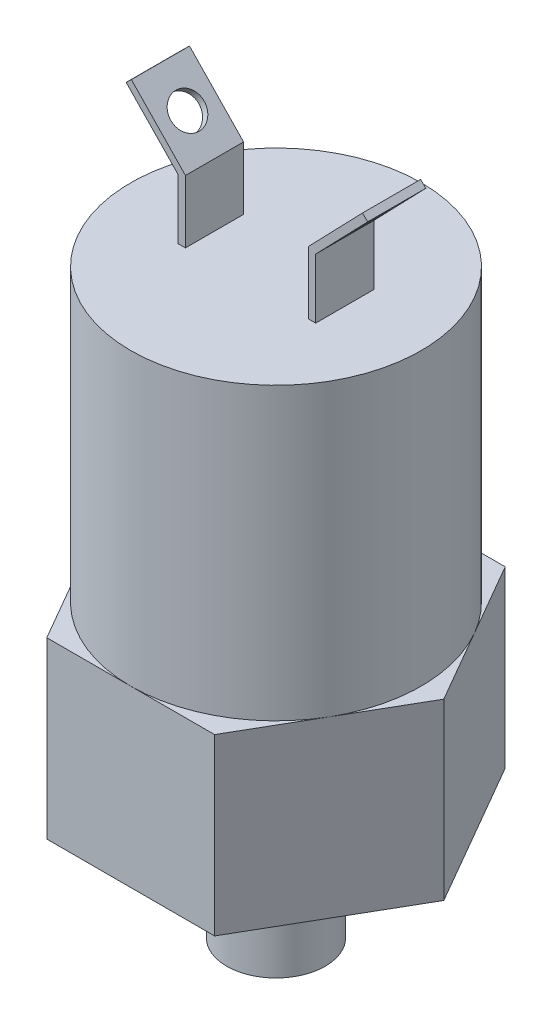
ISO-10303-21;
HEADER;
FILE_DESCRIPTION(('STEP AP214'),'2;1');
FILE_NAME('part.step','',(''),(''),'','','');
FILE_SCHEMA(('AUTOMOTIVE_DESIGN { 1 0 10303 214 1 1 1 1 }'));
ENDSEC;
DATA;
#1=APPLICATION_CONTEXT('core data for automotive mechanical design processes');
#2=APPLICATION_PROTOCOL_DEFINITION('international standard','automotive_design',2000,#1);
#3=PRODUCT_CONTEXT('',#1,'mechanical');
#4=PRODUCT('Part','Part','',(#3));
#5=PRODUCT_RELATED_PRODUCT_CATEGORY('part','',(#4));
#6=PRODUCT_DEFINITION_FORMATION('','',#4);
#7=PRODUCT_DEFINITION_CONTEXT('part definition',#1,'design');
#8=PRODUCT_DEFINITION('design','',#6,#7);
#9=PRODUCT_DEFINITION_SHAPE('','',#8);
#10=(LENGTH_UNIT() NAMED_UNIT(*) SI_UNIT(.MILLI.,.METRE.));
#11=(NAMED_UNIT(*) PLANE_ANGLE_UNIT() SI_UNIT($,.RADIAN.));
#12=(NAMED_UNIT(*) SI_UNIT($,.STERADIAN.) SOLID_ANGLE_UNIT());
#13=UNCERTAINTY_MEASURE_WITH_UNIT(LENGTH_MEASURE(1.E-05),#10,'distance_accuracy_value','');
#14=(GEOMETRIC_REPRESENTATION_CONTEXT(3) GLOBAL_UNCERTAINTY_ASSIGNED_CONTEXT((#13)) GLOBAL_UNIT_ASSIGNED_CONTEXT((#10,
#11,#12)) REPRESENTATION_CONTEXT('',''));
#15=CARTESIAN_POINT('',(0.,0.,0.));
#16=DIRECTION('',(0.,0.,1.));
#17=DIRECTION('',(1.,0.,0.));
#18=AXIS2_PLACEMENT_3D('',#15,#16,#17);
#19=CARTESIAN_POINT('',(-5.91916388064722,45.774740059957,2.54));
#20=DIRECTION('',(-0.719626723782185,-0.694361129685785,0.));
#21=DIRECTION('',(0.694361129685785,-0.719626723782185,0.));
#22=AXIS2_PLACEMENT_3D('',#19,#20,#21);
#23=PLANE('',#22);
#24=DIRECTION('',(-0.694361129685785,0.719626723782185,0.));
#25=VECTOR('',#24,1.);
#26=CARTESIAN_POINT('',(-5.91916388064722,45.774740059957,-2.54));
#27=LINE('',#26,#25);
#28=CARTESIAN_POINT('',(-6.00818239584637,45.8669976759295,-2.54));
#29=VERTEX_POINT('',#28);
#30=CARTESIAN_POINT('',(-10.5552709637061,50.5795403413248,-2.54));
#31=VERTEX_POINT('',#30);
#32=EDGE_CURVE('E183',#29,#31,#27,.T.);
#33=ORIENTED_EDGE('',*,*,#32,.F.);
#34=DIRECTION('',(0.,0.,-1.));
#35=VECTOR('',#34,1.);
#36=CARTESIAN_POINT('',(-6.00818239584637,45.8669976759295,2.54));
#37=LINE('',#36,#35);
#38=CARTESIAN_POINT('',(-6.00818239584637,45.8669976759295,2.54));
#39=VERTEX_POINT('',#38);
#40=EDGE_CURVE('E178',#39,#29,#37,.T.);
#41=ORIENTED_EDGE('',*,*,#40,.F.);
#42=DIRECTION('',(-0.694361129685785,0.719626723782185,0.));
#43=VECTOR('',#42,1.);
#44=CARTESIAN_POINT('',(-5.91916388064722,45.774740059957,2.54));
#45=LINE('',#44,#43);
#46=CARTESIAN_POINT('',(-10.5552709637061,50.5795403413248,2.54));
#47=VERTEX_POINT('',#46);
#48=EDGE_CURVE('E181',#39,#47,#45,.T.);
#49=ORIENTED_EDGE('',*,*,#48,.T.);
#50=DIRECTION('',(0.,0.,-1.));
#51=VECTOR('',#50,1.);
#52=CARTESIAN_POINT('',(-10.5552709637061,50.5795403413248,2.54));
#53=LINE('',#52,#51);
#54=EDGE_CURVE('E210',#47,#31,#53,.T.);
#55=ORIENTED_EDGE('',*,*,#54,.T.);
#56=EDGE_LOOP('',(#33,#41,#49,#55));
#57=FACE_BOUND('',#56,.T.);
#58=CARTESIAN_POINT('',(-8.19270816457709,48.1310113926547,0.));
#59=DIRECTION('',(-0.719626723782185,-0.694361129685785,0.));
#60=DIRECTION('',(0.694361129685785,-0.719626723782185,0.));
#61=AXIS2_PLACEMENT_3D('',#58,#59,#60);
#62=CIRCLE('',#61,1.4605);
#63=CARTESIAN_POINT('',(-7.17859373467101,47.0799965625708,0.));
#64=VERTEX_POINT('',#63);
#65=EDGE_CURVE('E213',#64,#64,#62,.T.);
#66=ORIENTED_EDGE('',*,*,#65,.F.);
#67=EDGE_LOOP('',(#66));
#68=FACE_BOUND('',#67,.T.);
#69=ADVANCED_FACE('F37',(#57,#68),#23,.T.);
#70=CARTESIAN_POINT('',(-5.46220091104553,46.2156593773075,2.54));
#71=DIRECTION('',(-0.719626723782185,-0.694361129685785,0.));
#72=DIRECTION('',(0.694361129685785,-0.719626723782185,0.));
#73=AXIS2_PLACEMENT_3D('',#70,#71,#72);
#74=PLANE('',#73);
#75=DIRECTION('',(-0.694361129685785,0.719626723782185,0.));
#76=VECTOR('',#75,1.);
#77=CARTESIAN_POINT('',(-5.46220091104553,46.2156593773075,-2.54));
#78=LINE('',#77,#76);
#79=CARTESIAN_POINT('',(-5.37318239584637,46.1234017613351,-2.54));
#80=VERTEX_POINT('',#79);
#81=CARTESIAN_POINT('',(-10.0983079941044,51.0204596586752,-2.54));
#82=VERTEX_POINT('',#81);
#83=EDGE_CURVE('E219',#80,#82,#78,.T.);
#84=ORIENTED_EDGE('',*,*,#83,.T.);
#85=DIRECTION('',(0.,0.,-1.));
#86=VECTOR('',#85,1.);
#87=CARTESIAN_POINT('',(-10.0983079941044,51.0204596586752,2.54));
#88=LINE('',#87,#86);
#89=CARTESIAN_POINT('',(-10.0983079941044,51.0204596586752,2.54));
#90=VERTEX_POINT('',#89);
#91=EDGE_CURVE('E224',#90,#82,#88,.T.);
#92=ORIENTED_EDGE('',*,*,#91,.F.);
#93=DIRECTION('',(-0.694361129685785,0.719626723782185,0.));
#94=VECTOR('',#93,1.);
#95=CARTESIAN_POINT('',(-5.46220091104553,46.2156593773075,2.54));
#96=LINE('',#95,#94);
#97=CARTESIAN_POINT('',(-5.37318239584637,46.1234017613351,2.54));
#98=VERTEX_POINT('',#97);
#99=EDGE_CURVE('E207',#98,#90,#96,.T.);
#100=ORIENTED_EDGE('',*,*,#99,.F.);
#101=DIRECTION('',(0.,0.,-1.));
#102=VECTOR('',#101,1.);
#103=CARTESIAN_POINT('',(-5.37318239584637,46.1234017613351,2.54));
#104=LINE('',#103,#102);
#105=EDGE_CURVE('E227',#98,#80,#104,.T.);
#106=ORIENTED_EDGE('',*,*,#105,.T.);
#107=EDGE_LOOP('',(#84,#92,#100,#106));
#108=FACE_BOUND('',#107,.T.);
#109=CARTESIAN_POINT('',(-7.7357451949754,48.5719307100052,0.));
#110=DIRECTION('',(-0.719626723782185,-0.694361129685785,0.));
#111=DIRECTION('',(0.694361129685785,-0.719626723782185,0.));
#112=AXIS2_PLACEMENT_3D('',#109,#110,#111);
#113=CIRCLE('',#112,1.4605);
#114=CARTESIAN_POINT('',(-6.72163076506931,47.5209158799213,0.));
#115=VERTEX_POINT('',#114);
#116=EDGE_CURVE('E694',#115,#115,#113,.T.);
#117=ORIENTED_EDGE('',*,*,#116,.T.);
#118=EDGE_LOOP('',(#117));
#119=FACE_BOUND('',#118,.T.);
#120=ADVANCED_FACE('F419',(#108,#119),#74,.F.);
#121=CARTESIAN_POINT('',(0.,40.64,0.));
#122=DIRECTION('',(0.,1.,0.));
#123=DIRECTION('',(0.,0.,1.));
#124=AXIS2_PLACEMENT_3D('',#121,#122,#123);
#125=PLANE('',#124);
#126=DIRECTION('',(0.,0.,-1.));
#127=VECTOR('',#126,1.);
#128=CARTESIAN_POINT('',(6.00818239584637,40.64,2.54));
#129=LINE('',#128,#127);
#130=CARTESIAN_POINT('',(6.00818239584637,40.64,2.54));
#131=VERTEX_POINT('',#130);
#132=CARTESIAN_POINT('',(6.00818239584637,40.64,-2.54));
#133=VERTEX_POINT('',#132);
#134=EDGE_CURVE('E272',#131,#133,#129,.T.);
#135=ORIENTED_EDGE('',*,*,#134,.F.);
#136=DIRECTION('',(-1.,0.,0.));
#137=VECTOR('',#136,1.);
#138=CARTESIAN_POINT('',(6.00818239584637,40.64,2.54));
#139=LINE('',#138,#137);
#140=CARTESIAN_POINT('',(5.37318239584637,40.64,2.54));
#141=VERTEX_POINT('',#140);
#142=EDGE_CURVE('E250',#131,#141,#139,.T.);
#143=ORIENTED_EDGE('',*,*,#142,.T.);
#144=DIRECTION('',(0.,0.,-1.));
#145=VECTOR('',#144,1.);
#146=CARTESIAN_POINT('',(5.37318239584637,40.64,2.54));
#147=LINE('',#146,#145);
#148=CARTESIAN_POINT('',(5.37318239584637,40.64,-2.54));
#149=VERTEX_POINT('',#148);
#150=EDGE_CURVE('E275',#141,#149,#147,.T.);
#151=ORIENTED_EDGE('',*,*,#150,.T.);
#152=DIRECTION('',(-1.,0.,0.));
#153=VECTOR('',#152,1.);
#154=CARTESIAN_POINT('',(6.00818239584637,40.64,-2.54));
#155=LINE('',#154,#153);
#156=EDGE_CURVE('E266',#133,#149,#155,.T.);
#157=ORIENTED_EDGE('',*,*,#156,.F.);
#158=EDGE_LOOP('',(#135,#143,#151,#157));
#159=FACE_BOUND('',#158,.T.);
#160=CARTESIAN_POINT('',(0.,40.64,0.));
#161=DIRECTION('',(0.,1.,0.));
#162=DIRECTION('',(0.,0.,1.));
#163=AXIS2_PLACEMENT_3D('',#160,#161,#162);
#164=CIRCLE('',#163,12.7);
#165=CARTESIAN_POINT('',(0.,40.64,12.7));
#166=VERTEX_POINT('',#165);
#167=EDGE_CURVE('E287',#166,#166,#164,.T.);
#168=ORIENTED_EDGE('',*,*,#167,.T.);
#169=EDGE_LOOP('',(#168));
#170=FACE_BOUND('',#169,.T.);
#171=DIRECTION('',(0.,0.,-1.));
#172=VECTOR('',#171,1.);
#173=CARTESIAN_POINT('',(-5.37318239584637,40.64,2.54));
#174=LINE('',#173,#172);
#175=CARTESIAN_POINT('',(-5.37318239584637,40.64,2.54));
#176=VERTEX_POINT('',#175);
#177=CARTESIAN_POINT('',(-5.37318239584637,40.64,-2.54));
#178=VERTEX_POINT('',#177);
#179=EDGE_CURVE('E57',#176,#178,#174,.T.);
#180=ORIENTED_EDGE('',*,*,#179,.F.);
#181=DIRECTION('',(1.,0.,0.));
#182=VECTOR('',#181,1.);
#183=CARTESIAN_POINT('',(-6.00818239584637,40.64,2.54));
#184=LINE('',#183,#182);
#185=CARTESIAN_POINT('',(-6.00818239584637,40.64,2.54));
#186=VERTEX_POINT('',#185);
#187=EDGE_CURVE('E52',#186,#176,#184,.T.);
#188=ORIENTED_EDGE('',*,*,#187,.F.);
#189=DIRECTION('',(0.,0.,-1.));
#190=VECTOR('',#189,1.);
#191=CARTESIAN_POINT('',(-6.00818239584637,40.64,2.54));
#192=LINE('',#191,#190);
#193=CARTESIAN_POINT('',(-6.00818239584637,40.64,-2.54));
#194=VERTEX_POINT('',#193);
#195=EDGE_CURVE('E189',#186,#194,#192,.T.);
#196=ORIENTED_EDGE('',*,*,#195,.T.);
#197=DIRECTION('',(1.,0.,0.));
#198=VECTOR('',#197,1.);
#199=CARTESIAN_POINT('',(-6.00818239584637,40.64,-2.54));
#200=LINE('',#199,#198);
#201=EDGE_CURVE('E215',#194,#178,#200,.T.);
#202=ORIENTED_EDGE('',*,*,#201,.T.);
#203=EDGE_LOOP('',(#180,#188,#196,#202));
#204=FACE_BOUND('',#203,.T.);
#205=ADVANCED_FACE('F425',(#159,#170,#204),#125,.T.);
#206=CARTESIAN_POINT('',(0.,0.,0.));
#207=DIRECTION('',(0.,1.,0.));
#208=DIRECTION('',(0.,0.,1.));
#209=AXIS2_PLACEMENT_3D('',#206,#207,#208);
#210=PLANE('',#209);
#211=DIRECTION('',(-0.5,0.,-0.866025403784439));
#212=VECTOR('',#211,1.);
#213=CARTESIAN_POINT('',(14.6646968374165,0.,0.));
#214=LINE('',#213,#212);
#215=CARTESIAN_POINT('',(14.6646968374165,0.,0.));
#216=VERTEX_POINT('',#215);
#217=CARTESIAN_POINT('',(7.33234841870825,0.,-12.7));
#218=VERTEX_POINT('',#217);
#219=EDGE_CURVE('E290',#216,#218,#214,.T.);
#220=ORIENTED_EDGE('',*,*,#219,.F.);
#221=DIRECTION('',(0.5,0.,-0.866025403784439));
#222=VECTOR('',#221,1.);
#223=CARTESIAN_POINT('',(7.33234841870825,0.,12.7));
#224=LINE('',#223,#222);
#225=CARTESIAN_POINT('',(7.33234841870825,0.,12.7));
#226=VERTEX_POINT('',#225);
#227=EDGE_CURVE('E328',#226,#216,#224,.T.);
#228=ORIENTED_EDGE('',*,*,#227,.F.);
#229=DIRECTION('',(1.,0.,0.));
#230=VECTOR('',#229,1.);
#231=CARTESIAN_POINT('',(-7.33234841870824,0.,12.7));
#232=LINE('',#231,#230);
#233=CARTESIAN_POINT('',(-7.33234841870824,0.,12.7));
#234=VERTEX_POINT('',#233);
#235=EDGE_CURVE('E326',#234,#226,#232,.T.);
#236=ORIENTED_EDGE('',*,*,#235,.F.);
#237=DIRECTION('',(0.5,0.,0.866025403784439));
#238=VECTOR('',#237,1.);
#239=CARTESIAN_POINT('',(-14.6646968374165,0.,0.));
#240=LINE('',#239,#238);
#241=CARTESIAN_POINT('',(-14.6646968374165,0.,0.));
#242=VERTEX_POINT('',#241);
#243=EDGE_CURVE('E324',#242,#234,#240,.T.);
#244=ORIENTED_EDGE('',*,*,#243,.F.);
#245=DIRECTION('',(-0.5,0.,0.866025403784439));
#246=VECTOR('',#245,1.);
#247=CARTESIAN_POINT('',(-7.33234841870825,0.,-12.7));
#248=LINE('',#247,#246);
#249=CARTESIAN_POINT('',(-7.33234841870825,0.,-12.7));
#250=VERTEX_POINT('',#249);
#251=EDGE_CURVE('E322',#250,#242,#248,.T.);
#252=ORIENTED_EDGE('',*,*,#251,.F.);
#253=DIRECTION('',(-1.,0.,0.));
#254=VECTOR('',#253,1.);
#255=CARTESIAN_POINT('',(7.33234841870825,0.,-12.7));
#256=LINE('',#255,#254);
#257=EDGE_CURVE('E320',#218,#250,#256,.T.);
#258=ORIENTED_EDGE('',*,*,#257,.F.);
#259=EDGE_LOOP('',(#220,#228,#236,#244,#252,#258));
#260=FACE_BOUND('',#259,.T.);
#261=CARTESIAN_POINT('',(0.,0.,0.));
#262=DIRECTION('',(0.,1.,0.));
#263=DIRECTION('',(0.,0.,1.));
#264=AXIS2_PLACEMENT_3D('',#261,#262,#263);
#265=CIRCLE('',#264,4.3053);
#266=CARTESIAN_POINT('',(0.,0.,4.3053));
#267=VERTEX_POINT('',#266);
#268=EDGE_CURVE('E11',#267,#267,#265,.F.);
#269=ORIENTED_EDGE('',*,*,#268,.F.);
#270=EDGE_LOOP('',(#269));
#271=FACE_BOUND('',#270,.T.);
#272=ADVANCED_FACE('F378',(#260,#271),#210,.F.);
#273=CARTESIAN_POINT('',(0.,15.24,0.));
#274=DIRECTION('',(0.,1.,0.));
#275=DIRECTION('',(0.,0.,1.));
#276=AXIS2_PLACEMENT_3D('',#273,#274,#275);
#277=PLANE('',#276);
#278=CARTESIAN_POINT('',(0.,15.24,0.));
#279=DIRECTION('',(0.,1.,0.));
#280=DIRECTION('',(0.,0.,1.));
#281=AXIS2_PLACEMENT_3D('',#278,#279,#280);
#282=CIRCLE('',#281,12.7);
#283=CARTESIAN_POINT('',(0.,15.24,12.7));
#284=VERTEX_POINT('',#283);
#285=CARTESIAN_POINT('',(10.9985226280624,15.24,6.35));
#286=VERTEX_POINT('',#285);
#287=EDGE_CURVE('E286',#284,#286,#282,.T.);
#288=ORIENTED_EDGE('',*,*,#287,.F.);
#289=DIRECTION('',(1.,0.,0.));
#290=VECTOR('',#289,1.);
#291=CARTESIAN_POINT('',(-7.33234841870824,15.24,12.7));
#292=LINE('',#291,#290);
#293=CARTESIAN_POINT('',(7.33234841870825,15.24,12.7));
#294=VERTEX_POINT('',#293);
#295=EDGE_CURVE('E310',#284,#294,#292,.T.);
#296=ORIENTED_EDGE('',*,*,#295,.T.);
#297=DIRECTION('',(0.5,0.,-0.866025403784439));
#298=VECTOR('',#297,1.);
#299=CARTESIAN_POINT('',(7.33234841870825,15.24,12.7));
#300=LINE('',#299,#298);
#301=EDGE_CURVE('E314',#294,#286,#300,.T.);
#302=ORIENTED_EDGE('',*,*,#301,.T.);
#303=EDGE_LOOP('',(#288,#296,#302));
#304=FACE_BOUND('',#303,.T.);
#305=ADVANCED_FACE('F368',(#304),#277,.T.);
#306=CARTESIAN_POINT('',(10.9985226280624,15.24,-6.35));
#307=VERTEX_POINT('',#306);
#308=EDGE_CURVE('E45',#286,#307,#282,.T.);
#309=ORIENTED_EDGE('',*,*,#308,.F.);
#310=CARTESIAN_POINT('',(14.6646968374165,15.24,0.));
#311=VERTEX_POINT('',#310);
#312=EDGE_CURVE('E313',#286,#311,#300,.T.);
#313=ORIENTED_EDGE('',*,*,#312,.T.);
#314=DIRECTION('',(-0.5,0.,-0.866025403784439));
#315=VECTOR('',#314,1.);
#316=CARTESIAN_POINT('',(14.6646968374165,15.24,0.));
#317=LINE('',#316,#315);
#318=EDGE_CURVE('E294',#311,#307,#317,.T.);
#319=ORIENTED_EDGE('',*,*,#318,.T.);
#320=EDGE_LOOP('',(#309,#313,#319));
#321=FACE_BOUND('',#320,.T.);
#322=ADVANCED_FACE('F361',(#321),#277,.T.);
#323=CARTESIAN_POINT('',(0.,15.24,-12.7));
#324=VERTEX_POINT('',#323);
#325=EDGE_CURVE('E354',#307,#324,#282,.T.);
#326=ORIENTED_EDGE('',*,*,#325,.F.);
#327=CARTESIAN_POINT('',(7.33234841870825,15.24,-12.7));
#328=VERTEX_POINT('',#327);
#329=EDGE_CURVE('E298',#307,#328,#317,.T.);
#330=ORIENTED_EDGE('',*,*,#329,.T.);
#331=DIRECTION('',(-1.,0.,0.));
#332=VECTOR('',#331,1.);
#333=CARTESIAN_POINT('',(7.33234841870825,15.24,-12.7));
#334=LINE('',#333,#332);
#335=EDGE_CURVE('E299',#328,#324,#334,.T.);
#336=ORIENTED_EDGE('',*,*,#335,.T.);
#337=EDGE_LOOP('',(#326,#330,#336));
#338=FACE_BOUND('',#337,.T.);
#339=ADVANCED_FACE('F385',(#338),#277,.T.);
#340=CARTESIAN_POINT('',(-10.9985226280624,15.24,-6.35));
#341=VERTEX_POINT('',#340);
#342=EDGE_CURVE('E352',#324,#341,#282,.T.);
#343=ORIENTED_EDGE('',*,*,#342,.F.);
#344=CARTESIAN_POINT('',(-7.33234841870825,15.24,-12.7));
#345=VERTEX_POINT('',#344);
#346=EDGE_CURVE('E297',#324,#345,#334,.T.);
#347=ORIENTED_EDGE('',*,*,#346,.T.);
#348=DIRECTION('',(-0.5,0.,0.866025403784439));
#349=VECTOR('',#348,1.);
#350=CARTESIAN_POINT('',(-7.33234841870825,15.24,-12.7));
#351=LINE('',#350,#349);
#352=EDGE_CURVE('E303',#345,#341,#351,.T.);
#353=ORIENTED_EDGE('',*,*,#352,.T.);
#354=EDGE_LOOP('',(#343,#347,#353));
#355=FACE_BOUND('',#354,.T.);
#356=ADVANCED_FACE('F391',(#355),#277,.T.);
#357=CARTESIAN_POINT('',(-10.9985226280624,15.24,6.35));
#358=VERTEX_POINT('',#357);
#359=EDGE_CURVE('E349',#341,#358,#282,.T.);
#360=ORIENTED_EDGE('',*,*,#359,.F.);
#361=CARTESIAN_POINT('',(-14.6646968374165,15.24,0.));
#362=VERTEX_POINT('',#361);
#363=EDGE_CURVE('E302',#341,#362,#351,.T.);
#364=ORIENTED_EDGE('',*,*,#363,.T.);
#365=DIRECTION('',(0.5,0.,0.866025403784439));
#366=VECTOR('',#365,1.);
#367=CARTESIAN_POINT('',(-14.6646968374165,15.24,0.));
#368=LINE('',#367,#366);
#369=EDGE_CURVE('E307',#362,#358,#368,.T.);
#370=ORIENTED_EDGE('',*,*,#369,.T.);
#371=EDGE_LOOP('',(#360,#364,#370));
#372=FACE_BOUND('',#371,.T.);
#373=ADVANCED_FACE('F398',(#372),#277,.T.);
#374=CARTESIAN_POINT('',(14.6646968374165,15.24,0.));
#375=DIRECTION('',(-0.866025403784439,0.,0.5));
#376=DIRECTION('',(0.5,0.,0.866025403784439));
#377=AXIS2_PLACEMENT_3D('',#374,#375,#376);
#378=PLANE('',#377);
#379=ORIENTED_EDGE('',*,*,#219,.T.);
#380=DIRECTION('',(0.,-1.,0.));
#381=VECTOR('',#380,1.);
#382=CARTESIAN_POINT('',(7.33234841870825,15.24,-12.7));
#383=LINE('',#382,#381);
#384=EDGE_CURVE('E343',#328,#218,#383,.T.);
#385=ORIENTED_EDGE('',*,*,#384,.F.);
#386=ORIENTED_EDGE('',*,*,#329,.F.);
#387=ORIENTED_EDGE('',*,*,#318,.F.);
#388=DIRECTION('',(0.,-1.,0.));
#389=VECTOR('',#388,1.);
#390=CARTESIAN_POINT('',(14.6646968374165,15.24,0.));
#391=LINE('',#390,#389);
#392=EDGE_CURVE('E317',#311,#216,#391,.T.);
#393=ORIENTED_EDGE('',*,*,#392,.T.);
#394=EDGE_LOOP('',(#379,#385,#386,#387,#393));
#395=FACE_BOUND('',#394,.T.);
#396=ADVANCED_FACE('F39',(#395),#378,.F.);
#397=CARTESIAN_POINT('',(7.33234841870825,15.24,-12.7));
#398=DIRECTION('',(0.,0.,1.));
#399=DIRECTION('',(1.,0.,0.));
#400=AXIS2_PLACEMENT_3D('',#397,#398,#399);
#401=PLANE('',#400);
#402=ORIENTED_EDGE('',*,*,#257,.T.);
#403=DIRECTION('',(0.,-1.,0.));
#404=VECTOR('',#403,1.);
#405=CARTESIAN_POINT('',(-7.33234841870825,15.24,-12.7));
#406=LINE('',#405,#404);
#407=EDGE_CURVE('E341',#345,#250,#406,.T.);
#408=ORIENTED_EDGE('',*,*,#407,.F.);
#409=ORIENTED_EDGE('',*,*,#346,.F.);
#410=ORIENTED_EDGE('',*,*,#335,.F.);
#411=ORIENTED_EDGE('',*,*,#384,.T.);
#412=EDGE_LOOP('',(#402,#408,#409,#410,#411));
#413=FACE_BOUND('',#412,.T.);
#414=ADVANCED_FACE('F387',(#413),#401,.F.);
#415=CARTESIAN_POINT('',(-7.33234841870825,15.24,-12.7));
#416=DIRECTION('',(0.866025403784439,0.,0.5));
#417=DIRECTION('',(0.5,0.,-0.866025403784439));
#418=AXIS2_PLACEMENT_3D('',#415,#416,#417);
#419=PLANE('',#418);
#420=ORIENTED_EDGE('',*,*,#251,.T.);
#421=DIRECTION('',(0.,-1.,0.));
#422=VECTOR('',#421,1.);
#423=CARTESIAN_POINT('',(-14.6646968374165,15.24,0.));
#424=LINE('',#423,#422);
#425=EDGE_CURVE('E338',#362,#242,#424,.T.);
#426=ORIENTED_EDGE('',*,*,#425,.F.);
#427=ORIENTED_EDGE('',*,*,#363,.F.);
#428=ORIENTED_EDGE('',*,*,#352,.F.);
#429=ORIENTED_EDGE('',*,*,#407,.T.);
#430=EDGE_LOOP('',(#420,#426,#427,#428,#429));
#431=FACE_BOUND('',#430,.T.);
#432=ADVANCED_FACE('F394',(#431),#419,.F.);
#433=CARTESIAN_POINT('',(-14.6646968374165,15.24,0.));
#434=DIRECTION('',(0.866025403784439,0.,-0.5));
#435=DIRECTION('',(-0.5,0.,-0.866025403784439));
#436=AXIS2_PLACEMENT_3D('',#433,#434,#435);
#437=PLANE('',#436);
#438=ORIENTED_EDGE('',*,*,#243,.T.);
#439=DIRECTION('',(0.,-1.,0.));
#440=VECTOR('',#439,1.);
#441=CARTESIAN_POINT('',(-7.33234841870824,15.24,12.7));
#442=LINE('',#441,#440);
#443=CARTESIAN_POINT('',(-7.33234841870824,15.24,12.7));
#444=VERTEX_POINT('',#443);
#445=EDGE_CURVE('E335',#444,#234,#442,.T.);
#446=ORIENTED_EDGE('',*,*,#445,.F.);
#447=EDGE_CURVE('E306',#358,#444,#368,.T.);
#448=ORIENTED_EDGE('',*,*,#447,.F.);
#449=ORIENTED_EDGE('',*,*,#369,.F.);
#450=ORIENTED_EDGE('',*,*,#425,.T.);
#451=EDGE_LOOP('',(#438,#446,#448,#449,#450));
#452=FACE_BOUND('',#451,.T.);
#453=ADVANCED_FACE('F401',(#452),#437,.F.);
#454=CARTESIAN_POINT('',(-7.33234841870824,15.24,12.7));
#455=DIRECTION('',(0.,0.,-1.));
#456=DIRECTION('',(-1.,0.,0.));
#457=AXIS2_PLACEMENT_3D('',#454,#455,#456);
#458=PLANE('',#457);
#459=ORIENTED_EDGE('',*,*,#235,.T.);
#460=DIRECTION('',(0.,-1.,0.));
#461=VECTOR('',#460,1.);
#462=CARTESIAN_POINT('',(7.33234841870825,15.24,12.7));
#463=LINE('',#462,#461);
#464=EDGE_CURVE('E332',#294,#226,#463,.T.);
#465=ORIENTED_EDGE('',*,*,#464,.F.);
#466=ORIENTED_EDGE('',*,*,#295,.F.);
#467=EDGE_CURVE('E311',#444,#284,#292,.T.);
#468=ORIENTED_EDGE('',*,*,#467,.F.);
#469=ORIENTED_EDGE('',*,*,#445,.T.);
#470=EDGE_LOOP('',(#459,#465,#466,#468,#469));
#471=FACE_BOUND('',#470,.T.);
#472=ADVANCED_FACE('F373',(#471),#458,.F.);
#473=CARTESIAN_POINT('',(7.33234841870825,15.24,12.7));
#474=DIRECTION('',(-0.866025403784439,0.,-0.5));
#475=DIRECTION('',(-0.5,0.,0.866025403784439));
#476=AXIS2_PLACEMENT_3D('',#473,#474,#475);
#477=PLANE('',#476);
#478=ORIENTED_EDGE('',*,*,#227,.T.);
#479=ORIENTED_EDGE('',*,*,#392,.F.);
#480=ORIENTED_EDGE('',*,*,#312,.F.);
#481=ORIENTED_EDGE('',*,*,#301,.F.);
#482=ORIENTED_EDGE('',*,*,#464,.T.);
#483=EDGE_LOOP('',(#478,#479,#480,#481,#482));
#484=FACE_BOUND('',#483,.T.);
#485=ADVANCED_FACE('F366',(#484),#477,.F.);
#486=EDGE_CURVE('E293',#358,#284,#282,.T.);
#487=ORIENTED_EDGE('',*,*,#486,.F.);
#488=ORIENTED_EDGE('',*,*,#447,.T.);
#489=ORIENTED_EDGE('',*,*,#467,.T.);
#490=EDGE_LOOP('',(#487,#488,#489));
#491=FACE_BOUND('',#490,.T.);
#492=ADVANCED_FACE('F404',(#491),#277,.T.);
#493=CARTESIAN_POINT('',(0.,40.64,0.));
#494=DIRECTION('',(0.,-1.,0.));
#495=DIRECTION('',(0.,0.,-1.));
#496=AXIS2_PLACEMENT_3D('',#493,#494,#495);
#497=CYLINDRICAL_SURFACE('',#496,12.7);
#498=ORIENTED_EDGE('',*,*,#167,.F.);
#499=EDGE_LOOP('',(#498));
#500=FACE_BOUND('',#499,.T.);
#501=ORIENTED_EDGE('',*,*,#287,.T.);
#502=ORIENTED_EDGE('',*,*,#308,.T.);
#503=ORIENTED_EDGE('',*,*,#325,.T.);
#504=ORIENTED_EDGE('',*,*,#342,.T.);
#505=ORIENTED_EDGE('',*,*,#359,.T.);
#506=ORIENTED_EDGE('',*,*,#486,.T.);
#507=EDGE_LOOP('',(#501,#502,#503,#504,#505,#506));
#508=FACE_BOUND('',#507,.T.);
#509=ADVANCED_FACE('F357',(#500,#508),#497,.T.);
#510=CARTESIAN_POINT('',(0.,-10.16,0.));
#511=DIRECTION('',(0.,1.,0.));
#512=DIRECTION('',(0.,0.,1.));
#513=AXIS2_PLACEMENT_3D('',#510,#511,#512);
#514=CYLINDRICAL_SURFACE('',#513,4.3053);
#515=CARTESIAN_POINT('',(0.,-10.16,0.));
#516=DIRECTION('',(0.,-1.,0.));
#517=DIRECTION('',(0.,0.,-1.));
#518=AXIS2_PLACEMENT_3D('',#515,#516,#517);
#519=CIRCLE('',#518,4.3053);
#520=CARTESIAN_POINT('',(0.,-10.16,-4.3053));
#521=VERTEX_POINT('',#520);
#522=EDGE_CURVE('E283',#521,#521,#519,.T.);
#523=ORIENTED_EDGE('',*,*,#522,.F.);
#524=EDGE_LOOP('',(#523));
#525=FACE_BOUND('',#524,.T.);
#526=ORIENTED_EDGE('',*,*,#268,.T.);
#527=EDGE_LOOP('',(#526));
#528=FACE_BOUND('',#527,.T.);
#529=ADVANCED_FACE('F411',(#525,#528),#514,.T.);
#530=CARTESIAN_POINT('',(0.,-10.16,0.));
#531=DIRECTION('',(0.,-1.,0.));
#532=DIRECTION('',(0.,0.,-1.));
#533=AXIS2_PLACEMENT_3D('',#530,#531,#532);
#534=PLANE('',#533);
#535=ORIENTED_EDGE('',*,*,#522,.T.);
#536=EDGE_LOOP('',(#535));
#537=FACE_BOUND('',#536,.T.);
#538=ADVANCED_FACE('F462',(#537),#534,.T.);
#539=CARTESIAN_POINT('',(5.91916388064722,45.774740059957,2.54));
#540=DIRECTION('',(-0.719626723782185,0.694361129685785,0.));
#541=DIRECTION('',(-0.694361129685785,-0.719626723782185,0.));
#542=AXIS2_PLACEMENT_3D('',#539,#540,#541);
#543=PLANE('',#542);
#544=CARTESIAN_POINT('',(8.19270816457709,48.1310113926547,0.));
#545=DIRECTION('',(-0.719626723782185,0.694361129685785,0.));
#546=DIRECTION('',(-0.694361129685785,-0.719626723782185,0.));
#547=AXIS2_PLACEMENT_3D('',#544,#545,#546);
#548=CIRCLE('',#547,1.4605);
#549=CARTESIAN_POINT('',(7.17859373467101,47.0799965625708,0.));
#550=VERTEX_POINT('',#549);
#551=EDGE_CURVE('E234',#550,#550,#548,.F.);
#552=ORIENTED_EDGE('',*,*,#551,.F.);
#553=EDGE_LOOP('',(#552));
#554=FACE_BOUND('',#553,.T.);
#555=DIRECTION('',(0.694361129685785,0.719626723782185,0.));
#556=VECTOR('',#555,1.);
#557=CARTESIAN_POINT('',(5.91916388064722,45.774740059957,-2.54));
#558=LINE('',#557,#556);
#559=CARTESIAN_POINT('',(6.00818239584637,45.8669976759295,-2.54));
#560=VERTEX_POINT('',#559);
#561=CARTESIAN_POINT('',(10.5552709637061,50.5795403413248,-2.54));
#562=VERTEX_POINT('',#561);
#563=EDGE_CURVE('E237',#560,#562,#558,.T.);
#564=ORIENTED_EDGE('',*,*,#563,.T.);
#565=DIRECTION('',(0.,0.,-1.));
#566=VECTOR('',#565,1.);
#567=CARTESIAN_POINT('',(10.5552709637061,50.5795403413248,2.54));
#568=LINE('',#567,#566);
#569=CARTESIAN_POINT('',(10.5552709637061,50.5795403413248,2.54));
#570=VERTEX_POINT('',#569);
#571=EDGE_CURVE('E281',#570,#562,#568,.T.);
#572=ORIENTED_EDGE('',*,*,#571,.F.);
#573=DIRECTION('',(0.694361129685785,0.719626723782185,0.));
#574=VECTOR('',#573,1.);
#575=CARTESIAN_POINT('',(5.91916388064722,45.774740059957,2.54));
#576=LINE('',#575,#574);
#577=CARTESIAN_POINT('',(6.00818239584637,45.8669976759295,2.54));
#578=VERTEX_POINT('',#577);
#579=EDGE_CURVE('E238',#578,#570,#576,.T.);
#580=ORIENTED_EDGE('',*,*,#579,.F.);
#581=DIRECTION('',(0.,0.,-1.));
#582=VECTOR('',#581,1.);
#583=CARTESIAN_POINT('',(6.00818239584637,45.8669976759295,2.54));
#584=LINE('',#583,#582);
#585=EDGE_CURVE('E254',#578,#560,#584,.T.);
#586=ORIENTED_EDGE('',*,*,#585,.T.);
#587=EDGE_LOOP('',(#564,#572,#580,#586));
#588=FACE_BOUND('',#587,.T.);
#589=ADVANCED_FACE('F458',(#554,#588),#543,.F.);
#590=CARTESIAN_POINT('',(10.0983079941044,51.0204596586752,2.54));
#591=DIRECTION('',(0.694361129685788,0.719626723782182,0.));
#592=DIRECTION('',(-0.719626723782182,0.694361129685788,0.));
#593=AXIS2_PLACEMENT_3D('',#590,#591,#592);
#594=PLANE('',#593);
#595=DIRECTION('',(0.719626723782182,-0.694361129685788,0.));
#596=VECTOR('',#595,1.);
#597=CARTESIAN_POINT('',(10.0983079941044,51.0204596586752,-2.54));
#598=LINE('',#597,#596);
#599=CARTESIAN_POINT('',(10.0983079941044,51.0204596586752,-2.54));
#600=VERTEX_POINT('',#599);
#601=EDGE_CURVE('E257',#600,#562,#598,.T.);
#602=ORIENTED_EDGE('',*,*,#601,.F.);
#603=DIRECTION('',(0.,0.,-1.));
#604=VECTOR('',#603,1.);
#605=CARTESIAN_POINT('',(10.0983079941044,51.0204596586752,2.54));
#606=LINE('',#605,#604);
#607=CARTESIAN_POINT('',(10.0983079941044,51.0204596586752,2.54));
#608=VERTEX_POINT('',#607);
#609=EDGE_CURVE('E279',#608,#600,#606,.T.);
#610=ORIENTED_EDGE('',*,*,#609,.F.);
#611=DIRECTION('',(0.719626723782182,-0.694361129685788,0.));
#612=VECTOR('',#611,1.);
#613=CARTESIAN_POINT('',(10.0983079941044,51.0204596586752,2.54));
#614=LINE('',#613,#612);
#615=EDGE_CURVE('E240',#608,#570,#614,.T.);
#616=ORIENTED_EDGE('',*,*,#615,.T.);
#617=ORIENTED_EDGE('',*,*,#571,.T.);
#618=EDGE_LOOP('',(#602,#610,#616,#617));
#619=FACE_BOUND('',#618,.T.);
#620=ADVANCED_FACE('F454',(#619),#594,.T.);
#621=CARTESIAN_POINT('',(5.46220091104553,46.2156593773075,2.54));
#622=DIRECTION('',(-0.719626723782185,0.694361129685785,0.));
#623=DIRECTION('',(-0.694361129685785,-0.719626723782185,0.));
#624=AXIS2_PLACEMENT_3D('',#621,#622,#623);
#625=PLANE('',#624);
#626=CARTESIAN_POINT('',(7.7357451949754,48.5719307100052,0.));
#627=DIRECTION('',(-0.719626723782185,0.694361129685785,0.));
#628=DIRECTION('',(-0.694361129685785,-0.719626723782185,0.));
#629=AXIS2_PLACEMENT_3D('',#626,#627,#628);
#630=CIRCLE('',#629,1.4605);
#631=CARTESIAN_POINT('',(6.72163076506931,47.5209158799213,0.));
#632=VERTEX_POINT('',#631);
#633=EDGE_CURVE('E188',#632,#632,#630,.T.);
#634=ORIENTED_EDGE('',*,*,#633,.F.);
#635=EDGE_LOOP('',(#634));
#636=FACE_BOUND('',#635,.T.);
#637=DIRECTION('',(0.694361129685785,0.719626723782185,0.));
#638=VECTOR('',#637,1.);
#639=CARTESIAN_POINT('',(5.46220091104553,46.2156593773075,-2.54));
#640=LINE('',#639,#638);
#641=CARTESIAN_POINT('',(5.37318239584637,46.1234017613351,-2.54));
#642=VERTEX_POINT('',#641);
#643=EDGE_CURVE('E260',#642,#600,#640,.T.);
#644=ORIENTED_EDGE('',*,*,#643,.F.);
#645=DIRECTION('',(0.,0.,-1.));
#646=VECTOR('',#645,1.);
#647=CARTESIAN_POINT('',(5.37318239584637,46.1234017613351,2.54));
#648=LINE('',#647,#646);
#649=CARTESIAN_POINT('',(5.37318239584637,46.1234017613351,2.54));
#650=VERTEX_POINT('',#649);
#651=EDGE_CURVE('E277',#650,#642,#648,.T.);
#652=ORIENTED_EDGE('',*,*,#651,.F.);
#653=DIRECTION('',(0.694361129685785,0.719626723782185,0.));
#654=VECTOR('',#653,1.);
#655=CARTESIAN_POINT('',(5.46220091104553,46.2156593773075,2.54));
#656=LINE('',#655,#654);
#657=EDGE_CURVE('E244',#650,#608,#656,.T.);
#658=ORIENTED_EDGE('',*,*,#657,.T.);
#659=ORIENTED_EDGE('',*,*,#609,.T.);
#660=EDGE_LOOP('',(#644,#652,#658,#659));
#661=FACE_BOUND('',#660,.T.);
#662=ADVANCED_FACE('F450',(#636,#661),#625,.T.);
#663=CARTESIAN_POINT('',(5.37318239584637,40.64,2.54));
#664=DIRECTION('',(-1.,0.,0.));
#665=DIRECTION('',(0.,0.,1.));
#666=AXIS2_PLACEMENT_3D('',#663,#664,#665);
#667=PLANE('',#666);
#668=DIRECTION('',(0.,1.,0.));
#669=VECTOR('',#668,1.);
#670=CARTESIAN_POINT('',(5.37318239584637,40.64,-2.54));
#671=LINE('',#670,#669);
#672=EDGE_CURVE('E263',#149,#642,#671,.T.);
#673=ORIENTED_EDGE('',*,*,#672,.F.);
#674=ORIENTED_EDGE('',*,*,#150,.F.);
#675=DIRECTION('',(0.,1.,0.));
#676=VECTOR('',#675,1.);
#677=CARTESIAN_POINT('',(5.37318239584637,40.64,2.54));
#678=LINE('',#677,#676);
#679=EDGE_CURVE('E247',#141,#650,#678,.T.);
#680=ORIENTED_EDGE('',*,*,#679,.T.);
#681=ORIENTED_EDGE('',*,*,#651,.T.);
#682=EDGE_LOOP('',(#673,#674,#680,#681));
#683=FACE_BOUND('',#682,.T.);
#684=ADVANCED_FACE('F446',(#683),#667,.T.);
#685=CARTESIAN_POINT('',(6.00818239584637,40.64,2.54));
#686=DIRECTION('',(-1.,0.,0.));
#687=DIRECTION('',(0.,0.,1.));
#688=AXIS2_PLACEMENT_3D('',#685,#686,#687);
#689=PLANE('',#688);
#690=DIRECTION('',(0.,1.,0.));
#691=VECTOR('',#690,1.);
#692=CARTESIAN_POINT('',(6.00818239584637,40.64,-2.54));
#693=LINE('',#692,#691);
#694=EDGE_CURVE('E241',#133,#560,#693,.T.);
#695=ORIENTED_EDGE('',*,*,#694,.T.);
#696=ORIENTED_EDGE('',*,*,#585,.F.);
#697=DIRECTION('',(0.,1.,0.));
#698=VECTOR('',#697,1.);
#699=CARTESIAN_POINT('',(6.00818239584637,40.64,2.54));
#700=LINE('',#699,#698);
#701=EDGE_CURVE('E252',#131,#578,#700,.T.);
#702=ORIENTED_EDGE('',*,*,#701,.F.);
#703=ORIENTED_EDGE('',*,*,#134,.T.);
#704=EDGE_LOOP('',(#695,#696,#702,#703));
#705=FACE_BOUND('',#704,.T.);
#706=ADVANCED_FACE('F439',(#705),#689,.F.);
#707=CARTESIAN_POINT('',(0.,0.,2.54));
#708=DIRECTION('',(0.,0.,-1.));
#709=DIRECTION('',(-1.,0.,0.));
#710=AXIS2_PLACEMENT_3D('',#707,#708,#709);
#711=PLANE('',#710);
#712=ORIENTED_EDGE('',*,*,#579,.T.);
#713=ORIENTED_EDGE('',*,*,#615,.F.);
#714=ORIENTED_EDGE('',*,*,#657,.F.);
#715=ORIENTED_EDGE('',*,*,#679,.F.);
#716=ORIENTED_EDGE('',*,*,#142,.F.);
#717=ORIENTED_EDGE('',*,*,#701,.T.);
#718=EDGE_LOOP('',(#712,#713,#714,#715,#716,#717));
#719=FACE_BOUND('',#718,.T.);
#720=ADVANCED_FACE('F436',(#719),#711,.F.);
#721=CARTESIAN_POINT('',(0.,0.,-2.54));
#722=DIRECTION('',(0.,0.,-1.));
#723=DIRECTION('',(-1.,0.,0.));
#724=AXIS2_PLACEMENT_3D('',#721,#722,#723);
#725=PLANE('',#724);
#726=ORIENTED_EDGE('',*,*,#563,.F.);
#727=ORIENTED_EDGE('',*,*,#694,.F.);
#728=ORIENTED_EDGE('',*,*,#156,.T.);
#729=ORIENTED_EDGE('',*,*,#672,.T.);
#730=ORIENTED_EDGE('',*,*,#643,.T.);
#731=ORIENTED_EDGE('',*,*,#601,.T.);
#732=EDGE_LOOP('',(#726,#727,#728,#729,#730,#731));
#733=FACE_BOUND('',#732,.T.);
#734=ADVANCED_FACE('F434',(#733),#725,.T.);
#735=CARTESIAN_POINT('',(40.67222738461,16.7918255175907,0.));
#736=DIRECTION('',(-0.719626723782184,0.694361129685785,0.));
#737=DIRECTION('',(-0.694361129685785,-0.719626723782184,0.));
#738=AXIS2_PLACEMENT_3D('',#735,#736,#737);
#739=CYLINDRICAL_SURFACE('',#738,1.4605);
#740=ORIENTED_EDGE('',*,*,#633,.T.);
#741=EDGE_LOOP('',(#740));
#742=FACE_BOUND('',#741,.T.);
#743=ORIENTED_EDGE('',*,*,#551,.T.);
#744=EDGE_LOOP('',(#743));
#745=FACE_BOUND('',#744,.T.);
#746=ADVANCED_FACE('F431',(#742,#745),#739,.F.);
#747=CARTESIAN_POINT('',(-6.00818239584637,40.64,2.54));
#748=DIRECTION('',(-1.,0.,0.));
#749=DIRECTION('',(0.,0.,1.));
#750=AXIS2_PLACEMENT_3D('',#747,#748,#749);
#751=PLANE('',#750);
#752=DIRECTION('',(0.,1.,0.));
#753=VECTOR('',#752,1.);
#754=CARTESIAN_POINT('',(-6.00818239584637,40.64,-2.54));
#755=LINE('',#754,#753);
#756=EDGE_CURVE('E212',#194,#29,#755,.T.);
#757=ORIENTED_EDGE('',*,*,#756,.F.);
#758=ORIENTED_EDGE('',*,*,#195,.F.);
#759=DIRECTION('',(0.,1.,0.));
#760=VECTOR('',#759,1.);
#761=CARTESIAN_POINT('',(-6.00818239584637,40.64,2.54));
#762=LINE('',#761,#760);
#763=EDGE_CURVE('E194',#186,#39,#762,.T.);
#764=ORIENTED_EDGE('',*,*,#763,.T.);
#765=ORIENTED_EDGE('',*,*,#40,.T.);
#766=EDGE_LOOP('',(#757,#758,#764,#765));
#767=FACE_BOUND('',#766,.T.);
#768=ADVANCED_FACE('F200',(#767),#751,.T.);
#769=CARTESIAN_POINT('',(-5.37318239584637,40.64,2.54));
#770=DIRECTION('',(-1.,0.,0.));
#771=DIRECTION('',(0.,0.,1.));
#772=AXIS2_PLACEMENT_3D('',#769,#770,#771);
#773=PLANE('',#772);
#774=DIRECTION('',(0.,1.,0.));
#775=VECTOR('',#774,1.);
#776=CARTESIAN_POINT('',(-5.37318239584637,40.64,-2.54));
#777=LINE('',#776,#775);
#778=EDGE_CURVE('E217',#178,#80,#777,.T.);
#779=ORIENTED_EDGE('',*,*,#778,.T.);
#780=ORIENTED_EDGE('',*,*,#105,.F.);
#781=DIRECTION('',(0.,1.,0.));
#782=VECTOR('',#781,1.);
#783=CARTESIAN_POINT('',(-5.37318239584637,40.64,2.54));
#784=LINE('',#783,#782);
#785=EDGE_CURVE('E202',#176,#98,#784,.T.);
#786=ORIENTED_EDGE('',*,*,#785,.F.);
#787=ORIENTED_EDGE('',*,*,#179,.T.);
#788=EDGE_LOOP('',(#779,#780,#786,#787));
#789=FACE_BOUND('',#788,.T.);
#790=ADVANCED_FACE('F607',(#789),#773,.F.);
#791=CARTESIAN_POINT('',(-10.0983079941044,51.0204596586752,2.54));
#792=DIRECTION('',(0.694361129685788,-0.719626723782182,0.));
#793=DIRECTION('',(0.719626723782182,0.694361129685788,0.));
#794=AXIS2_PLACEMENT_3D('',#791,#792,#793);
#795=PLANE('',#794);
#796=DIRECTION('',(-0.719626723782182,-0.694361129685788,0.));
#797=VECTOR('',#796,1.);
#798=CARTESIAN_POINT('',(-10.0983079941044,51.0204596586752,-2.54));
#799=LINE('',#798,#797);
#800=EDGE_CURVE('E198',#82,#31,#799,.T.);
#801=ORIENTED_EDGE('',*,*,#800,.T.);
#802=ORIENTED_EDGE('',*,*,#54,.F.);
#803=DIRECTION('',(-0.719626723782182,-0.694361129685788,0.));
#804=VECTOR('',#803,1.);
#805=CARTESIAN_POINT('',(-10.0983079941044,51.0204596586752,2.54));
#806=LINE('',#805,#804);
#807=EDGE_CURVE('E196',#90,#47,#806,.T.);
#808=ORIENTED_EDGE('',*,*,#807,.F.);
#809=ORIENTED_EDGE('',*,*,#91,.T.);
#810=EDGE_LOOP('',(#801,#802,#808,#809));
#811=FACE_BOUND('',#810,.T.);
#812=ADVANCED_FACE('F615',(#811),#795,.F.);
#813=CARTESIAN_POINT('',(0.,0.,2.54));
#814=DIRECTION('',(0.,0.,-1.));
#815=DIRECTION('',(1.,0.,0.));
#816=AXIS2_PLACEMENT_3D('',#813,#814,#815);
#817=PLANE('',#816);
#818=ORIENTED_EDGE('',*,*,#48,.F.);
#819=ORIENTED_EDGE('',*,*,#763,.F.);
#820=ORIENTED_EDGE('',*,*,#187,.T.);
#821=ORIENTED_EDGE('',*,*,#785,.T.);
#822=ORIENTED_EDGE('',*,*,#99,.T.);
#823=ORIENTED_EDGE('',*,*,#807,.T.);
#824=EDGE_LOOP('',(#818,#819,#820,#821,#822,#823));
#825=FACE_BOUND('',#824,.T.);
#826=ADVANCED_FACE('F193',(#825),#817,.F.);
#827=CARTESIAN_POINT('',(0.,0.,-2.54));
#828=DIRECTION('',(0.,0.,-1.));
#829=DIRECTION('',(1.,0.,0.));
#830=AXIS2_PLACEMENT_3D('',#827,#828,#829);
#831=PLANE('',#830);
#832=ORIENTED_EDGE('',*,*,#32,.T.);
#833=ORIENTED_EDGE('',*,*,#800,.F.);
#834=ORIENTED_EDGE('',*,*,#83,.F.);
#835=ORIENTED_EDGE('',*,*,#778,.F.);
#836=ORIENTED_EDGE('',*,*,#201,.F.);
#837=ORIENTED_EDGE('',*,*,#756,.T.);
#838=EDGE_LOOP('',(#832,#833,#834,#835,#836,#837));
#839=FACE_BOUND('',#838,.T.);
#840=ADVANCED_FACE('F633',(#839),#831,.T.);
#841=CARTESIAN_POINT('',(-40.67222738461,16.7918255175907,0.));
#842=DIRECTION('',(0.719626723782184,0.694361129685785,0.));
#843=DIRECTION('',(-0.694361129685785,0.719626723782184,0.));
#844=AXIS2_PLACEMENT_3D('',#841,#842,#843);
#845=CYLINDRICAL_SURFACE('',#844,1.4605);
#846=ORIENTED_EDGE('',*,*,#65,.T.);
#847=EDGE_LOOP('',(#846));
#848=FACE_BOUND('',#847,.T.);
#849=ORIENTED_EDGE('',*,*,#116,.F.);
#850=EDGE_LOOP('',(#849));
#851=FACE_BOUND('',#850,.T.);
#852=ADVANCED_FACE('F642',(#848,#851),#845,.F.);
#853=CLOSED_SHELL('',(#69,#120,#205,#272,#305,#322,#339,#356,#373,#396,#414,#432,#453,#472,#485,
#492,#509,#529,#538,#589,#620,#662,#684,#706,#720,#734,#746,#768,#790,#812,#826,#840,#852));
#854=MANIFOLD_SOLID_BREP('B2',#853);
#855=ADVANCED_BREP_SHAPE_REPRESENTATION('',(#18,#854),#14);
#856=SHAPE_DEFINITION_REPRESENTATION(#9,#855);
ENDSEC;
END-ISO-10303-21;
